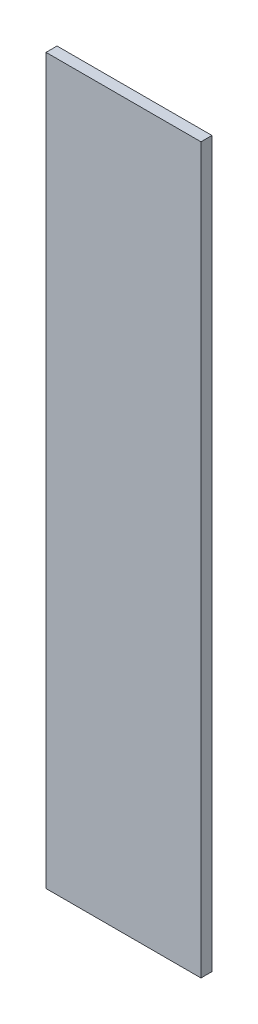
ISO-10303-21;
HEADER;
FILE_DESCRIPTION(('STEP AP214'),'2;1');
FILE_NAME('part.step','',(''),(''),'','','');
FILE_SCHEMA(('AUTOMOTIVE_DESIGN { 1 0 10303 214 1 1 1 1 }'));
ENDSEC;
DATA;
#1=APPLICATION_CONTEXT('core data for automotive mechanical design processes');
#2=APPLICATION_PROTOCOL_DEFINITION('international standard','automotive_design',2000,#1);
#3=PRODUCT_CONTEXT('',#1,'mechanical');
#4=PRODUCT('Part','Part','',(#3));
#5=PRODUCT_RELATED_PRODUCT_CATEGORY('part','',(#4));
#6=PRODUCT_DEFINITION_FORMATION('','',#4);
#7=PRODUCT_DEFINITION_CONTEXT('part definition',#1,'design');
#8=PRODUCT_DEFINITION('design','',#6,#7);
#9=PRODUCT_DEFINITION_SHAPE('','',#8);
#10=(LENGTH_UNIT() NAMED_UNIT(*) SI_UNIT(.MILLI.,.METRE.));
#11=(NAMED_UNIT(*) PLANE_ANGLE_UNIT() SI_UNIT($,.RADIAN.));
#12=(NAMED_UNIT(*) SI_UNIT($,.STERADIAN.) SOLID_ANGLE_UNIT());
#13=UNCERTAINTY_MEASURE_WITH_UNIT(LENGTH_MEASURE(1.E-05),#10,'distance_accuracy_value','');
#14=(GEOMETRIC_REPRESENTATION_CONTEXT(3) GLOBAL_UNCERTAINTY_ASSIGNED_CONTEXT((#13)) GLOBAL_UNIT_ASSIGNED_CONTEXT((#10,
#11,#12)) REPRESENTATION_CONTEXT('',''));
#15=CARTESIAN_POINT('',(0.,0.,0.));
#16=DIRECTION('',(0.,0.,1.));
#17=DIRECTION('',(1.,0.,0.));
#18=AXIS2_PLACEMENT_3D('',#15,#16,#17);
#19=CARTESIAN_POINT('',(3.4258972848564,-0.920280972424119,0.));
#20=DIRECTION('',(1.,0.,0.));
#21=DIRECTION('',(0.,1.,0.));
#22=AXIS2_PLACEMENT_3D('',#19,#20,#21);
#23=PLANE('',#22);
#24=DIRECTION('',(0.,1.,0.));
#25=VECTOR('',#24,1.);
#26=CARTESIAN_POINT('',(3.4258972848564,-0.920280972424119,0.));
#27=LINE('',#26,#25);
#28=CARTESIAN_POINT('',(3.4258972848564,-0.920280972424119,0.));
#29=VERTEX_POINT('',#28);
#30=CARTESIAN_POINT('',(3.4258972848564,-0.722871127763473,0.));
#31=VERTEX_POINT('',#30);
#32=EDGE_CURVE('E11',#29,#31,#27,.T.);
#33=ORIENTED_EDGE('',*,*,#32,.T.);
#34=DIRECTION('',(0.,0.,1.));
#35=VECTOR('',#34,1.);
#36=CARTESIAN_POINT('',(3.4258972848564,-0.722871127763473,0.));
#37=LINE('',#36,#35);
#38=CARTESIAN_POINT('',(3.4258972848564,-0.722871127763473,0.003));
#39=VERTEX_POINT('',#38);
#40=EDGE_CURVE('E24',#31,#39,#37,.T.);
#41=ORIENTED_EDGE('',*,*,#40,.T.);
#42=DIRECTION('',(0.,1.,0.));
#43=VECTOR('',#42,1.);
#44=CARTESIAN_POINT('',(3.4258972848564,-0.920280972424119,0.003));
#45=LINE('',#44,#43);
#46=CARTESIAN_POINT('',(3.4258972848564,-0.920280972424119,0.003));
#47=VERTEX_POINT('',#46);
#48=EDGE_CURVE('E75',#47,#39,#45,.T.);
#49=ORIENTED_EDGE('',*,*,#48,.F.);
#50=DIRECTION('',(0.,0.,1.));
#51=VECTOR('',#50,1.);
#52=CARTESIAN_POINT('',(3.4258972848564,-0.920280972424119,0.));
#53=LINE('',#52,#51);
#54=EDGE_CURVE('E86',#29,#47,#53,.T.);
#55=ORIENTED_EDGE('',*,*,#54,.F.);
#56=EDGE_LOOP('',(#33,#41,#49,#55));
#57=FACE_BOUND('',#56,.T.);
#58=ADVANCED_FACE('F17',(#57),#23,.T.);
#59=CARTESIAN_POINT('',(3.3836678446747,-0.920280972424119,0.));
#60=DIRECTION('',(0.,-1.,0.));
#61=DIRECTION('',(1.,0.,0.));
#62=AXIS2_PLACEMENT_3D('',#59,#60,#61);
#63=PLANE('',#62);
#64=DIRECTION('',(1.,0.,0.));
#65=VECTOR('',#64,1.);
#66=CARTESIAN_POINT('',(3.3836678446747,-0.920280972424119,0.));
#67=LINE('',#66,#65);
#68=CARTESIAN_POINT('',(3.3836678446747,-0.920280972424119,0.));
#69=VERTEX_POINT('',#68);
#70=EDGE_CURVE('E83',#69,#29,#67,.T.);
#71=ORIENTED_EDGE('',*,*,#70,.T.);
#72=ORIENTED_EDGE('',*,*,#54,.T.);
#73=DIRECTION('',(1.,0.,0.));
#74=VECTOR('',#73,1.);
#75=CARTESIAN_POINT('',(3.3836678446747,-0.920280972424119,0.003));
#76=LINE('',#75,#74);
#77=CARTESIAN_POINT('',(3.3836678446747,-0.920280972424119,0.003));
#78=VERTEX_POINT('',#77);
#79=EDGE_CURVE('E81',#78,#47,#76,.T.);
#80=ORIENTED_EDGE('',*,*,#79,.F.);
#81=DIRECTION('',(0.,0.,1.));
#82=VECTOR('',#81,1.);
#83=CARTESIAN_POINT('',(3.3836678446747,-0.920280972424119,0.));
#84=LINE('',#83,#82);
#85=EDGE_CURVE('E61',#69,#78,#84,.T.);
#86=ORIENTED_EDGE('',*,*,#85,.F.);
#87=EDGE_LOOP('',(#71,#72,#80,#86));
#88=FACE_BOUND('',#87,.T.);
#89=ADVANCED_FACE('F91',(#88),#63,.T.);
#90=CARTESIAN_POINT('',(3.3836678446747,-0.722871127763473,0.));
#91=DIRECTION('',(-1.,0.,0.));
#92=DIRECTION('',(0.,-1.,0.));
#93=AXIS2_PLACEMENT_3D('',#90,#91,#92);
#94=PLANE('',#93);
#95=DIRECTION('',(0.,-1.,0.));
#96=VECTOR('',#95,1.);
#97=CARTESIAN_POINT('',(3.3836678446747,-0.722871127763473,0.));
#98=LINE('',#97,#96);
#99=CARTESIAN_POINT('',(3.3836678446747,-0.722871127763473,0.));
#100=VERTEX_POINT('',#99);
#101=EDGE_CURVE('E65',#100,#69,#98,.T.);
#102=ORIENTED_EDGE('',*,*,#101,.T.);
#103=ORIENTED_EDGE('',*,*,#85,.T.);
#104=DIRECTION('',(0.,-1.,0.));
#105=VECTOR('',#104,1.);
#106=CARTESIAN_POINT('',(3.3836678446747,-0.722871127763473,0.003));
#107=LINE('',#106,#105);
#108=CARTESIAN_POINT('',(3.3836678446747,-0.722871127763473,0.003));
#109=VERTEX_POINT('',#108);
#110=EDGE_CURVE('E54',#109,#78,#107,.T.);
#111=ORIENTED_EDGE('',*,*,#110,.F.);
#112=DIRECTION('',(0.,0.,1.));
#113=VECTOR('',#112,1.);
#114=CARTESIAN_POINT('',(3.3836678446747,-0.722871127763473,0.));
#115=LINE('',#114,#113);
#116=EDGE_CURVE('E58',#100,#109,#115,.T.);
#117=ORIENTED_EDGE('',*,*,#116,.F.);
#118=EDGE_LOOP('',(#102,#103,#111,#117));
#119=FACE_BOUND('',#118,.T.);
#120=ADVANCED_FACE('F57',(#119),#94,.T.);
#121=CARTESIAN_POINT('',(3.4258972848564,-0.722871127763473,0.));
#122=DIRECTION('',(0.,1.,0.));
#123=DIRECTION('',(-1.,0.,0.));
#124=AXIS2_PLACEMENT_3D('',#121,#122,#123);
#125=PLANE('',#124);
#126=DIRECTION('',(-1.,0.,0.));
#127=VECTOR('',#126,1.);
#128=CARTESIAN_POINT('',(3.4258972848564,-0.722871127763473,0.));
#129=LINE('',#128,#127);
#130=EDGE_CURVE('E71',#31,#100,#129,.T.);
#131=ORIENTED_EDGE('',*,*,#130,.T.);
#132=ORIENTED_EDGE('',*,*,#116,.T.);
#133=DIRECTION('',(-1.,0.,0.));
#134=VECTOR('',#133,1.);
#135=CARTESIAN_POINT('',(3.4258972848564,-0.722871127763473,0.003));
#136=LINE('',#135,#134);
#137=EDGE_CURVE('E70',#39,#109,#136,.T.);
#138=ORIENTED_EDGE('',*,*,#137,.F.);
#139=ORIENTED_EDGE('',*,*,#40,.F.);
#140=EDGE_LOOP('',(#131,#132,#138,#139));
#141=FACE_BOUND('',#140,.T.);
#142=ADVANCED_FACE('F69',(#141),#125,.T.);
#143=CARTESIAN_POINT('',(3.4047825647655,-0.821576050093796,0.003));
#144=DIRECTION('',(0.,0.,1.));
#145=DIRECTION('',(1.,0.,0.));
#146=AXIS2_PLACEMENT_3D('',#143,#144,#145);
#147=PLANE('',#146);
#148=ORIENTED_EDGE('',*,*,#137,.T.);
#149=ORIENTED_EDGE('',*,*,#110,.T.);
#150=ORIENTED_EDGE('',*,*,#79,.T.);
#151=ORIENTED_EDGE('',*,*,#48,.T.);
#152=EDGE_LOOP('',(#148,#149,#150,#151));
#153=FACE_BOUND('',#152,.T.);
#154=ADVANCED_FACE('F74',(#153),#147,.T.);
#155=CARTESIAN_POINT('',(3.4047825647655,-0.821576050093796,0.));
#156=DIRECTION('',(0.,0.,1.));
#157=DIRECTION('',(1.,0.,0.));
#158=AXIS2_PLACEMENT_3D('',#155,#156,#157);
#159=PLANE('',#158);
#160=ORIENTED_EDGE('',*,*,#130,.F.);
#161=ORIENTED_EDGE('',*,*,#32,.F.);
#162=ORIENTED_EDGE('',*,*,#70,.F.);
#163=ORIENTED_EDGE('',*,*,#101,.F.);
#164=EDGE_LOOP('',(#160,#161,#162,#163));
#165=FACE_BOUND('',#164,.T.);
#166=ADVANCED_FACE('F89',(#165),#159,.F.);
#167=CLOSED_SHELL('',(#58,#89,#120,#142,#154,#166));
#168=MANIFOLD_SOLID_BREP('B1',#167);
#169=ADVANCED_BREP_SHAPE_REPRESENTATION('',(#18,#168),#14);
#170=SHAPE_DEFINITION_REPRESENTATION(#9,#169);
ENDSEC;
END-ISO-10303-21;
